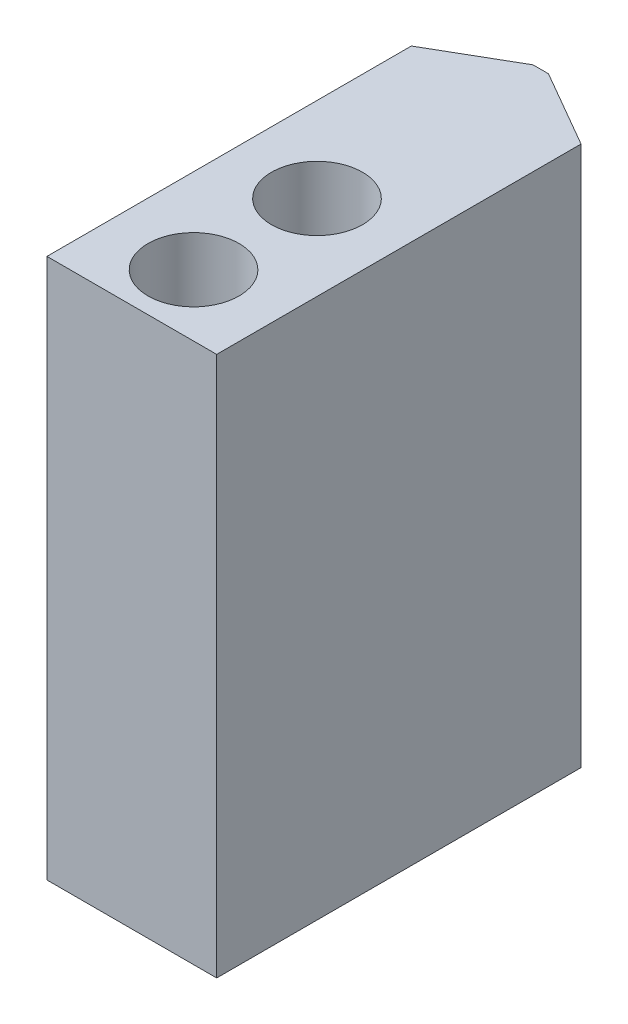
ISO-10303-21;
HEADER;
FILE_DESCRIPTION(('STEP AP214'),'2;1');
FILE_NAME('part.step','',(''),(''),'','','');
FILE_SCHEMA(('AUTOMOTIVE_DESIGN { 1 0 10303 214 1 1 1 1 }'));
ENDSEC;
DATA;
#1=APPLICATION_CONTEXT('core data for automotive mechanical design processes');
#2=APPLICATION_PROTOCOL_DEFINITION('international standard','automotive_design',2000,#1);
#3=PRODUCT_CONTEXT('',#1,'mechanical');
#4=PRODUCT('Part','Part','',(#3));
#5=PRODUCT_RELATED_PRODUCT_CATEGORY('part','',(#4));
#6=PRODUCT_DEFINITION_FORMATION('','',#4);
#7=PRODUCT_DEFINITION_CONTEXT('part definition',#1,'design');
#8=PRODUCT_DEFINITION('design','',#6,#7);
#9=PRODUCT_DEFINITION_SHAPE('','',#8);
#10=(LENGTH_UNIT() NAMED_UNIT(*) SI_UNIT(.MILLI.,.METRE.));
#11=(NAMED_UNIT(*) PLANE_ANGLE_UNIT() SI_UNIT($,.RADIAN.));
#12=(NAMED_UNIT(*) SI_UNIT($,.STERADIAN.) SOLID_ANGLE_UNIT());
#13=UNCERTAINTY_MEASURE_WITH_UNIT(LENGTH_MEASURE(1.E-05),#10,'distance_accuracy_value','');
#14=(GEOMETRIC_REPRESENTATION_CONTEXT(3) GLOBAL_UNCERTAINTY_ASSIGNED_CONTEXT((#13)) GLOBAL_UNIT_ASSIGNED_CONTEXT((#10,
#11,#12)) REPRESENTATION_CONTEXT('',''));
#15=CARTESIAN_POINT('',(0.,0.,0.));
#16=DIRECTION('',(0.,0.,1.));
#17=DIRECTION('',(1.,0.,0.));
#18=AXIS2_PLACEMENT_3D('',#15,#16,#17);
#19=CARTESIAN_POINT('',(-5.5,35.,2.8867513459481));
#20=DIRECTION('',(1.,0.,0.));
#21=DIRECTION('',(0.,0.,-1.));
#22=AXIS2_PLACEMENT_3D('',#19,#20,#21);
#23=PLANE('',#22);
#24=DIRECTION('',(0.,0.,1.));
#25=VECTOR('',#24,1.);
#26=CARTESIAN_POINT('',(-5.5,0.,2.8867513459481));
#27=LINE('',#26,#25);
#28=CARTESIAN_POINT('',(-5.5,0.,2.8867513459481));
#29=VERTEX_POINT('',#28);
#30=CARTESIAN_POINT('',(-5.5,0.,26.5));
#31=VERTEX_POINT('',#30);
#32=EDGE_CURVE('E130',#29,#31,#27,.T.);
#33=ORIENTED_EDGE('',*,*,#32,.T.);
#34=DIRECTION('',(0.,-1.,0.));
#35=VECTOR('',#34,1.);
#36=CARTESIAN_POINT('',(-5.5,35.,26.5));
#37=LINE('',#36,#35);
#38=CARTESIAN_POINT('',(-5.5,35.,26.5));
#39=VERTEX_POINT('',#38);
#40=EDGE_CURVE('E11',#39,#31,#37,.T.);
#41=ORIENTED_EDGE('',*,*,#40,.F.);
#42=DIRECTION('',(0.,0.,1.));
#43=VECTOR('',#42,1.);
#44=CARTESIAN_POINT('',(-5.5,35.,2.8867513459481));
#45=LINE('',#44,#43);
#46=CARTESIAN_POINT('',(-5.5,35.,2.8867513459481));
#47=VERTEX_POINT('',#46);
#48=EDGE_CURVE('E147',#47,#39,#45,.T.);
#49=ORIENTED_EDGE('',*,*,#48,.F.);
#50=DIRECTION('',(0.,-1.,0.));
#51=VECTOR('',#50,1.);
#52=CARTESIAN_POINT('',(-5.5,35.,2.8867513459481));
#53=LINE('',#52,#51);
#54=EDGE_CURVE('E126',#47,#29,#53,.T.);
#55=ORIENTED_EDGE('',*,*,#54,.T.);
#56=EDGE_LOOP('',(#33,#41,#49,#55));
#57=FACE_BOUND('',#56,.T.);
#58=ADVANCED_FACE('F40',(#57),#23,.F.);
#59=CARTESIAN_POINT('',(-5.5,35.,26.5));
#60=DIRECTION('',(0.,0.,-1.));
#61=DIRECTION('',(-1.,0.,0.));
#62=AXIS2_PLACEMENT_3D('',#59,#60,#61);
#63=PLANE('',#62);
#64=DIRECTION('',(1.,0.,0.));
#65=VECTOR('',#64,1.);
#66=CARTESIAN_POINT('',(-5.5,0.,26.5));
#67=LINE('',#66,#65);
#68=CARTESIAN_POINT('',(5.5,0.,26.5));
#69=VERTEX_POINT('',#68);
#70=EDGE_CURVE('E134',#31,#69,#67,.T.);
#71=ORIENTED_EDGE('',*,*,#70,.T.);
#72=DIRECTION('',(0.,-1.,0.));
#73=VECTOR('',#72,1.);
#74=CARTESIAN_POINT('',(5.5,35.,26.5));
#75=LINE('',#74,#73);
#76=CARTESIAN_POINT('',(5.5,35.,26.5));
#77=VERTEX_POINT('',#76);
#78=EDGE_CURVE('E49',#77,#69,#75,.T.);
#79=ORIENTED_EDGE('',*,*,#78,.F.);
#80=DIRECTION('',(1.,0.,0.));
#81=VECTOR('',#80,1.);
#82=CARTESIAN_POINT('',(-5.5,35.,26.5));
#83=LINE('',#82,#81);
#84=EDGE_CURVE('E94',#39,#77,#83,.T.);
#85=ORIENTED_EDGE('',*,*,#84,.F.);
#86=ORIENTED_EDGE('',*,*,#40,.T.);
#87=EDGE_LOOP('',(#71,#79,#85,#86));
#88=FACE_BOUND('',#87,.T.);
#89=ADVANCED_FACE('F177',(#88),#63,.F.);
#90=CARTESIAN_POINT('',(5.5,35.,26.5));
#91=DIRECTION('',(-1.,0.,0.));
#92=DIRECTION('',(0.,0.,1.));
#93=AXIS2_PLACEMENT_3D('',#90,#91,#92);
#94=PLANE('',#93);
#95=DIRECTION('',(0.,0.,-1.));
#96=VECTOR('',#95,1.);
#97=CARTESIAN_POINT('',(5.5,0.,26.5));
#98=LINE('',#97,#96);
#99=CARTESIAN_POINT('',(5.5,0.,2.8867513459481));
#100=VERTEX_POINT('',#99);
#101=EDGE_CURVE('E138',#69,#100,#98,.T.);
#102=ORIENTED_EDGE('',*,*,#101,.T.);
#103=DIRECTION('',(0.,-1.,0.));
#104=VECTOR('',#103,1.);
#105=CARTESIAN_POINT('',(5.5,35.,2.8867513459481));
#106=LINE('',#105,#104);
#107=CARTESIAN_POINT('',(5.5,35.,2.8867513459481));
#108=VERTEX_POINT('',#107);
#109=EDGE_CURVE('E118',#108,#100,#106,.T.);
#110=ORIENTED_EDGE('',*,*,#109,.F.);
#111=DIRECTION('',(0.,0.,-1.));
#112=VECTOR('',#111,1.);
#113=CARTESIAN_POINT('',(5.5,35.,26.5));
#114=LINE('',#113,#112);
#115=EDGE_CURVE('E107',#77,#108,#114,.T.);
#116=ORIENTED_EDGE('',*,*,#115,.F.);
#117=ORIENTED_EDGE('',*,*,#78,.T.);
#118=EDGE_LOOP('',(#102,#110,#116,#117));
#119=FACE_BOUND('',#118,.T.);
#120=ADVANCED_FACE('F158',(#119),#94,.F.);
#121=CARTESIAN_POINT('',(5.5,35.,2.8867513459481));
#122=DIRECTION('',(-0.499999999999996,0.,0.866025403784441));
#123=DIRECTION('',(0.866025403784441,0.,0.499999999999996));
#124=AXIS2_PLACEMENT_3D('',#121,#122,#123);
#125=PLANE('',#124);
#126=DIRECTION('',(-0.866025403784441,0.,-0.499999999999996));
#127=VECTOR('',#126,1.);
#128=CARTESIAN_POINT('',(5.5,0.,2.8867513459481));
#129=LINE('',#128,#127);
#130=CARTESIAN_POINT('',(0.5,0.,0.));
#131=VERTEX_POINT('',#130);
#132=EDGE_CURVE('E116',#100,#131,#129,.T.);
#133=ORIENTED_EDGE('',*,*,#132,.T.);
#134=DIRECTION('',(0.,-1.,0.));
#135=VECTOR('',#134,1.);
#136=CARTESIAN_POINT('',(0.5,35.,0.));
#137=LINE('',#136,#135);
#138=CARTESIAN_POINT('',(0.5,35.,0.));
#139=VERTEX_POINT('',#138);
#140=EDGE_CURVE('E113',#139,#131,#137,.T.);
#141=ORIENTED_EDGE('',*,*,#140,.F.);
#142=DIRECTION('',(-0.866025403784441,0.,-0.499999999999996));
#143=VECTOR('',#142,1.);
#144=CARTESIAN_POINT('',(5.5,35.,2.8867513459481));
#145=LINE('',#144,#143);
#146=EDGE_CURVE('E101',#108,#139,#145,.T.);
#147=ORIENTED_EDGE('',*,*,#146,.F.);
#148=ORIENTED_EDGE('',*,*,#109,.T.);
#149=EDGE_LOOP('',(#133,#141,#147,#148));
#150=FACE_BOUND('',#149,.T.);
#151=ADVANCED_FACE('F114',(#150),#125,.F.);
#152=CARTESIAN_POINT('',(0.5,35.,0.));
#153=DIRECTION('',(0.,0.,1.));
#154=DIRECTION('',(1.,0.,0.));
#155=AXIS2_PLACEMENT_3D('',#152,#153,#154);
#156=PLANE('',#155);
#157=DIRECTION('',(-1.,0.,0.));
#158=VECTOR('',#157,1.);
#159=CARTESIAN_POINT('',(0.5,0.,0.));
#160=LINE('',#159,#158);
#161=CARTESIAN_POINT('',(-0.5,0.,0.));
#162=VERTEX_POINT('',#161);
#163=EDGE_CURVE('E80',#131,#162,#160,.T.);
#164=ORIENTED_EDGE('',*,*,#163,.T.);
#165=DIRECTION('',(0.,-1.,0.));
#166=VECTOR('',#165,1.);
#167=CARTESIAN_POINT('',(-0.5,35.,0.));
#168=LINE('',#167,#166);
#169=CARTESIAN_POINT('',(-0.5,35.,0.));
#170=VERTEX_POINT('',#169);
#171=EDGE_CURVE('E119',#170,#162,#168,.T.);
#172=ORIENTED_EDGE('',*,*,#171,.F.);
#173=DIRECTION('',(-1.,0.,0.));
#174=VECTOR('',#173,1.);
#175=CARTESIAN_POINT('',(0.5,35.,0.));
#176=LINE('',#175,#174);
#177=EDGE_CURVE('E105',#139,#170,#176,.T.);
#178=ORIENTED_EDGE('',*,*,#177,.F.);
#179=ORIENTED_EDGE('',*,*,#140,.T.);
#180=EDGE_LOOP('',(#164,#172,#178,#179));
#181=FACE_BOUND('',#180,.T.);
#182=ADVANCED_FACE('F121',(#181),#156,.F.);
#183=CARTESIAN_POINT('',(-0.5,35.,0.));
#184=DIRECTION('',(0.499999999999996,0.,0.866025403784441));
#185=DIRECTION('',(0.866025403784441,0.,-0.499999999999996));
#186=AXIS2_PLACEMENT_3D('',#183,#184,#185);
#187=PLANE('',#186);
#188=DIRECTION('',(-0.866025403784441,0.,0.499999999999996));
#189=VECTOR('',#188,1.);
#190=CARTESIAN_POINT('',(-0.5,0.,0.));
#191=LINE('',#190,#189);
#192=EDGE_CURVE('E86',#162,#29,#191,.T.);
#193=ORIENTED_EDGE('',*,*,#192,.T.);
#194=ORIENTED_EDGE('',*,*,#54,.F.);
#195=DIRECTION('',(-0.866025403784441,0.,0.499999999999996));
#196=VECTOR('',#195,1.);
#197=CARTESIAN_POINT('',(-0.5,35.,0.));
#198=LINE('',#197,#196);
#199=EDGE_CURVE('E57',#170,#47,#198,.T.);
#200=ORIENTED_EDGE('',*,*,#199,.F.);
#201=ORIENTED_EDGE('',*,*,#171,.T.);
#202=EDGE_LOOP('',(#193,#194,#200,#201));
#203=FACE_BOUND('',#202,.T.);
#204=ADVANCED_FACE('F165',(#203),#187,.F.);
#205=CARTESIAN_POINT('',(0.,35.,0.));
#206=DIRECTION('',(0.,1.,0.));
#207=DIRECTION('',(0.,0.,1.));
#208=AXIS2_PLACEMENT_3D('',#205,#206,#207);
#209=PLANE('',#208);
#210=CARTESIAN_POINT('',(0.,35.,22.5));
#211=DIRECTION('',(0.,1.,0.));
#212=DIRECTION('',(0.,0.,1.));
#213=AXIS2_PLACEMENT_3D('',#210,#211,#212);
#214=CIRCLE('',#213,2.95);
#215=CARTESIAN_POINT('',(0.,35.,25.45));
#216=VERTEX_POINT('',#215);
#217=EDGE_CURVE('E428',#216,#216,#214,.T.);
#218=ORIENTED_EDGE('',*,*,#217,.F.);
#219=EDGE_LOOP('',(#218));
#220=FACE_BOUND('',#219,.T.);
#221=CARTESIAN_POINT('',(0.,35.,14.5));
#222=DIRECTION('',(0.,1.,0.));
#223=DIRECTION('',(0.,0.,1.));
#224=AXIS2_PLACEMENT_3D('',#221,#222,#223);
#225=CIRCLE('',#224,2.95);
#226=CARTESIAN_POINT('',(0.,35.,17.45));
#227=VERTEX_POINT('',#226);
#228=EDGE_CURVE('E135',#227,#227,#225,.T.);
#229=ORIENTED_EDGE('',*,*,#228,.F.);
#230=EDGE_LOOP('',(#229));
#231=FACE_BOUND('',#230,.T.);
#232=ORIENTED_EDGE('',*,*,#48,.T.);
#233=ORIENTED_EDGE('',*,*,#84,.T.);
#234=ORIENTED_EDGE('',*,*,#115,.T.);
#235=ORIENTED_EDGE('',*,*,#146,.T.);
#236=ORIENTED_EDGE('',*,*,#177,.T.);
#237=ORIENTED_EDGE('',*,*,#199,.T.);
#238=EDGE_LOOP('',(#232,#233,#234,#235,#236,#237));
#239=FACE_BOUND('',#238,.T.);
#240=ADVANCED_FACE('F103',(#220,#231,#239),#209,.T.);
#241=CARTESIAN_POINT('',(0.,0.,0.));
#242=DIRECTION('',(0.,1.,0.));
#243=DIRECTION('',(0.,0.,1.));
#244=AXIS2_PLACEMENT_3D('',#241,#242,#243);
#245=PLANE('',#244);
#246=CARTESIAN_POINT('',(0.,0.,22.5));
#247=DIRECTION('',(0.,1.,0.));
#248=DIRECTION('',(0.,0.,1.));
#249=AXIS2_PLACEMENT_3D('',#246,#247,#248);
#250=CIRCLE('',#249,2.5);
#251=CARTESIAN_POINT('',(0.,0.,25.));
#252=VERTEX_POINT('',#251);
#253=EDGE_CURVE('E409',#252,#252,#250,.T.);
#254=ORIENTED_EDGE('',*,*,#253,.T.);
#255=EDGE_LOOP('',(#254));
#256=FACE_BOUND('',#255,.T.);
#257=CARTESIAN_POINT('',(0.,0.,14.5));
#258=DIRECTION('',(0.,1.,0.));
#259=DIRECTION('',(0.,0.,1.));
#260=AXIS2_PLACEMENT_3D('',#257,#258,#259);
#261=CIRCLE('',#260,2.5);
#262=CARTESIAN_POINT('',(0.,0.,17.));
#263=VERTEX_POINT('',#262);
#264=EDGE_CURVE('E432',#263,#263,#261,.T.);
#265=ORIENTED_EDGE('',*,*,#264,.T.);
#266=EDGE_LOOP('',(#265));
#267=FACE_BOUND('',#266,.T.);
#268=ORIENTED_EDGE('',*,*,#32,.F.);
#269=ORIENTED_EDGE('',*,*,#192,.F.);
#270=ORIENTED_EDGE('',*,*,#163,.F.);
#271=ORIENTED_EDGE('',*,*,#132,.F.);
#272=ORIENTED_EDGE('',*,*,#101,.F.);
#273=ORIENTED_EDGE('',*,*,#70,.F.);
#274=EDGE_LOOP('',(#268,#269,#270,#271,#272,#273));
#275=FACE_BOUND('',#274,.T.);
#276=ADVANCED_FACE('F161',(#256,#267,#275),#245,.F.);
#277=CARTESIAN_POINT('',(0.,0.,14.5));
#278=DIRECTION('',(0.,1.,0.));
#279=DIRECTION('',(0.,0.,1.));
#280=AXIS2_PLACEMENT_3D('',#277,#278,#279);
#281=CYLINDRICAL_SURFACE('',#280,2.95);
#282=ORIENTED_EDGE('',*,*,#228,.T.);
#283=EDGE_LOOP('',(#282));
#284=FACE_BOUND('',#283,.T.);
#285=CARTESIAN_POINT('',(0.,6.,14.5));
#286=DIRECTION('',(0.,1.,0.));
#287=DIRECTION('',(0.,0.,1.));
#288=AXIS2_PLACEMENT_3D('',#285,#286,#287);
#289=CIRCLE('',#288,2.95);
#290=CARTESIAN_POINT('',(0.,6.,17.45));
#291=VERTEX_POINT('',#290);
#292=EDGE_CURVE('E448',#291,#291,#289,.T.);
#293=ORIENTED_EDGE('',*,*,#292,.F.);
#294=EDGE_LOOP('',(#293));
#295=FACE_BOUND('',#294,.T.);
#296=ADVANCED_FACE('F216',(#284,#295),#281,.F.);
#297=CARTESIAN_POINT('',(0.,6.,11.55));
#298=DIRECTION('',(0.,1.,0.));
#299=DIRECTION('',(0.,0.,1.));
#300=AXIS2_PLACEMENT_3D('',#297,#298,#299);
#301=PLANE('',#300);
#302=ORIENTED_EDGE('',*,*,#292,.T.);
#303=EDGE_LOOP('',(#302));
#304=FACE_BOUND('',#303,.T.);
#305=CARTESIAN_POINT('',(0.,6.,14.5));
#306=DIRECTION('',(0.,1.,0.));
#307=DIRECTION('',(0.,0.,1.));
#308=AXIS2_PLACEMENT_3D('',#305,#306,#307);
#309=CIRCLE('',#308,1.6);
#310=CARTESIAN_POINT('',(0.,6.,16.1));
#311=VERTEX_POINT('',#310);
#312=EDGE_CURVE('E444',#311,#311,#309,.T.);
#313=ORIENTED_EDGE('',*,*,#312,.F.);
#314=EDGE_LOOP('',(#313));
#315=FACE_BOUND('',#314,.T.);
#316=ADVANCED_FACE('F226',(#304,#315),#301,.T.);
#317=CARTESIAN_POINT('',(0.,0.,14.5));
#318=DIRECTION('',(0.,1.,0.));
#319=DIRECTION('',(0.,0.,1.));
#320=AXIS2_PLACEMENT_3D('',#317,#318,#319);
#321=CYLINDRICAL_SURFACE('',#320,1.6);
#322=ORIENTED_EDGE('',*,*,#312,.T.);
#323=EDGE_LOOP('',(#322));
#324=FACE_BOUND('',#323,.T.);
#325=CARTESIAN_POINT('',(0.,1.3,14.5));
#326=DIRECTION('',(0.,1.,0.));
#327=DIRECTION('',(0.,0.,1.));
#328=AXIS2_PLACEMENT_3D('',#325,#326,#327);
#329=CIRCLE('',#328,1.6);
#330=CARTESIAN_POINT('',(0.,1.3,16.1));
#331=VERTEX_POINT('',#330);
#332=EDGE_CURVE('E440',#331,#331,#329,.T.);
#333=ORIENTED_EDGE('',*,*,#332,.F.);
#334=EDGE_LOOP('',(#333));
#335=FACE_BOUND('',#334,.T.);
#336=ADVANCED_FACE('F237',(#324,#335),#321,.F.);
#337=CARTESIAN_POINT('',(0.,1.3,12.9));
#338=DIRECTION('',(0.,-1.,0.));
#339=DIRECTION('',(0.,0.,-1.));
#340=AXIS2_PLACEMENT_3D('',#337,#338,#339);
#341=PLANE('',#340);
#342=ORIENTED_EDGE('',*,*,#332,.T.);
#343=EDGE_LOOP('',(#342));
#344=FACE_BOUND('',#343,.T.);
#345=CARTESIAN_POINT('',(0.,1.3,14.5));
#346=DIRECTION('',(0.,1.,0.));
#347=DIRECTION('',(0.,0.,1.));
#348=AXIS2_PLACEMENT_3D('',#345,#346,#347);
#349=CIRCLE('',#348,2.5);
#350=CARTESIAN_POINT('',(0.,1.3,17.));
#351=VERTEX_POINT('',#350);
#352=EDGE_CURVE('E436',#351,#351,#349,.T.);
#353=ORIENTED_EDGE('',*,*,#352,.F.);
#354=EDGE_LOOP('',(#353));
#355=FACE_BOUND('',#354,.T.);
#356=ADVANCED_FACE('F246',(#344,#355),#341,.T.);
#357=CARTESIAN_POINT('',(0.,0.,14.5));
#358=DIRECTION('',(0.,1.,0.));
#359=DIRECTION('',(0.,0.,1.));
#360=AXIS2_PLACEMENT_3D('',#357,#358,#359);
#361=CYLINDRICAL_SURFACE('',#360,2.5);
#362=ORIENTED_EDGE('',*,*,#352,.T.);
#363=EDGE_LOOP('',(#362));
#364=FACE_BOUND('',#363,.T.);
#365=ORIENTED_EDGE('',*,*,#264,.F.);
#366=EDGE_LOOP('',(#365));
#367=FACE_BOUND('',#366,.T.);
#368=ADVANCED_FACE('F256',(#364,#367),#361,.F.);
#369=CARTESIAN_POINT('',(0.,0.,22.5));
#370=DIRECTION('',(0.,1.,0.));
#371=DIRECTION('',(0.,0.,1.));
#372=AXIS2_PLACEMENT_3D('',#369,#370,#371);
#373=CYLINDRICAL_SURFACE('',#372,2.95);
#374=ORIENTED_EDGE('',*,*,#217,.T.);
#375=EDGE_LOOP('',(#374));
#376=FACE_BOUND('',#375,.T.);
#377=CARTESIAN_POINT('',(0.,6.,22.5));
#378=DIRECTION('',(0.,1.,0.));
#379=DIRECTION('',(0.,0.,1.));
#380=AXIS2_PLACEMENT_3D('',#377,#378,#379);
#381=CIRCLE('',#380,2.95);
#382=CARTESIAN_POINT('',(0.,6.,25.45));
#383=VERTEX_POINT('',#382);
#384=EDGE_CURVE('E424',#383,#383,#381,.T.);
#385=ORIENTED_EDGE('',*,*,#384,.F.);
#386=EDGE_LOOP('',(#385));
#387=FACE_BOUND('',#386,.T.);
#388=ADVANCED_FACE('F265',(#376,#387),#373,.F.);
#389=CARTESIAN_POINT('',(0.,6.,19.55));
#390=DIRECTION('',(0.,1.,0.));
#391=DIRECTION('',(0.,0.,1.));
#392=AXIS2_PLACEMENT_3D('',#389,#390,#391);
#393=PLANE('',#392);
#394=ORIENTED_EDGE('',*,*,#384,.T.);
#395=EDGE_LOOP('',(#394));
#396=FACE_BOUND('',#395,.T.);
#397=CARTESIAN_POINT('',(0.,6.,22.5));
#398=DIRECTION('',(0.,1.,0.));
#399=DIRECTION('',(0.,0.,1.));
#400=AXIS2_PLACEMENT_3D('',#397,#398,#399);
#401=CIRCLE('',#400,1.6);
#402=CARTESIAN_POINT('',(0.,6.,24.1));
#403=VERTEX_POINT('',#402);
#404=EDGE_CURVE('E420',#403,#403,#401,.T.);
#405=ORIENTED_EDGE('',*,*,#404,.F.);
#406=EDGE_LOOP('',(#405));
#407=FACE_BOUND('',#406,.T.);
#408=ADVANCED_FACE('F275',(#396,#407),#393,.T.);
#409=CARTESIAN_POINT('',(0.,0.,22.5));
#410=DIRECTION('',(0.,1.,0.));
#411=DIRECTION('',(0.,0.,1.));
#412=AXIS2_PLACEMENT_3D('',#409,#410,#411);
#413=CYLINDRICAL_SURFACE('',#412,1.6);
#414=ORIENTED_EDGE('',*,*,#404,.T.);
#415=EDGE_LOOP('',(#414));
#416=FACE_BOUND('',#415,.T.);
#417=CARTESIAN_POINT('',(0.,1.3,22.5));
#418=DIRECTION('',(0.,1.,0.));
#419=DIRECTION('',(0.,0.,1.));
#420=AXIS2_PLACEMENT_3D('',#417,#418,#419);
#421=CIRCLE('',#420,1.6);
#422=CARTESIAN_POINT('',(0.,1.3,24.1));
#423=VERTEX_POINT('',#422);
#424=EDGE_CURVE('E414',#423,#423,#421,.T.);
#425=ORIENTED_EDGE('',*,*,#424,.F.);
#426=EDGE_LOOP('',(#425));
#427=FACE_BOUND('',#426,.T.);
#428=ADVANCED_FACE('F285',(#416,#427),#413,.F.);
#429=CARTESIAN_POINT('',(0.,1.3,20.9));
#430=DIRECTION('',(0.,-1.,0.));
#431=DIRECTION('',(0.,0.,-1.));
#432=AXIS2_PLACEMENT_3D('',#429,#430,#431);
#433=PLANE('',#432);
#434=ORIENTED_EDGE('',*,*,#424,.T.);
#435=EDGE_LOOP('',(#434));
#436=FACE_BOUND('',#435,.T.);
#437=CARTESIAN_POINT('',(0.,1.3,22.5));
#438=DIRECTION('',(0.,1.,0.));
#439=DIRECTION('',(0.,0.,1.));
#440=AXIS2_PLACEMENT_3D('',#437,#438,#439);
#441=CIRCLE('',#440,2.5);
#442=CARTESIAN_POINT('',(0.,1.3,25.));
#443=VERTEX_POINT('',#442);
#444=EDGE_CURVE('E406',#443,#443,#441,.T.);
#445=ORIENTED_EDGE('',*,*,#444,.F.);
#446=EDGE_LOOP('',(#445));
#447=FACE_BOUND('',#446,.T.);
#448=ADVANCED_FACE('F294',(#436,#447),#433,.T.);
#449=CARTESIAN_POINT('',(0.,0.,22.5));
#450=DIRECTION('',(0.,1.,0.));
#451=DIRECTION('',(0.,0.,1.));
#452=AXIS2_PLACEMENT_3D('',#449,#450,#451);
#453=CYLINDRICAL_SURFACE('',#452,2.5);
#454=ORIENTED_EDGE('',*,*,#444,.T.);
#455=EDGE_LOOP('',(#454));
#456=FACE_BOUND('',#455,.T.);
#457=ORIENTED_EDGE('',*,*,#253,.F.);
#458=EDGE_LOOP('',(#457));
#459=FACE_BOUND('',#458,.T.);
#460=ADVANCED_FACE('F304',(#456,#459),#453,.F.);
#461=CLOSED_SHELL('',(#58,#89,#120,#151,#182,#204,#240,#276,#296,#316,#336,#356,#368,#388,#408,
#428,#448,#460));
#462=MANIFOLD_SOLID_BREP('B2',#461);
#463=ADVANCED_BREP_SHAPE_REPRESENTATION('',(#18,#462),#14);
#464=SHAPE_DEFINITION_REPRESENTATION(#9,#463);
ENDSEC;
END-ISO-10303-21;
